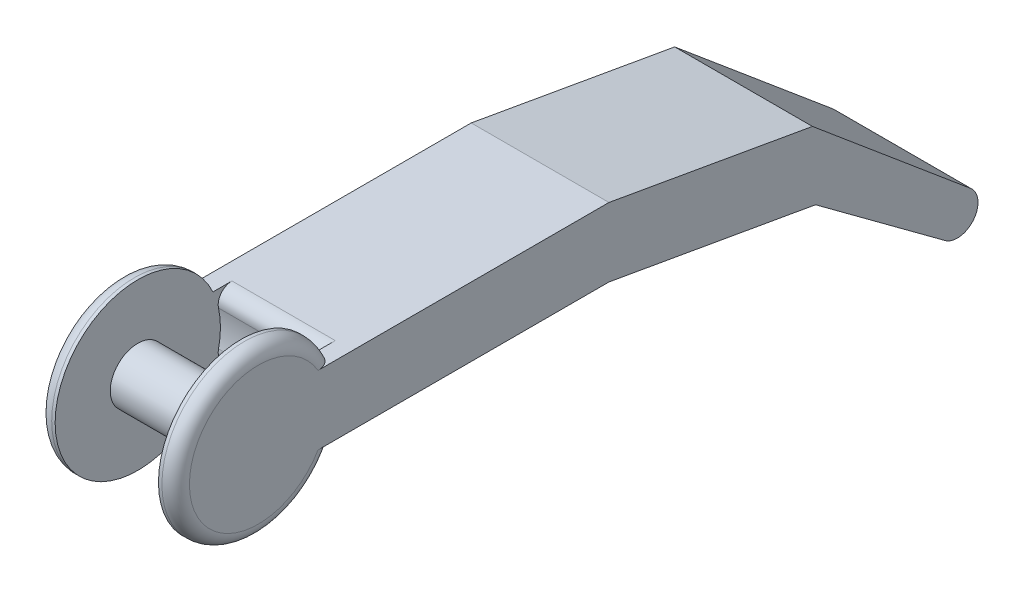
ISO-10303-21;
HEADER;
FILE_DESCRIPTION(('STEP AP214'),'2;1');
FILE_NAME('part.step','',(''),(''),'','','');
FILE_SCHEMA(('AUTOMOTIVE_DESIGN { 1 0 10303 214 1 1 1 1 }'));
ENDSEC;
DATA;
#1=APPLICATION_CONTEXT('core data for automotive mechanical design processes');
#2=APPLICATION_PROTOCOL_DEFINITION('international standard','automotive_design',2000,#1);
#3=PRODUCT_CONTEXT('',#1,'mechanical');
#4=PRODUCT('Part','Part','',(#3));
#5=PRODUCT_RELATED_PRODUCT_CATEGORY('part','',(#4));
#6=PRODUCT_DEFINITION_FORMATION('','',#4);
#7=PRODUCT_DEFINITION_CONTEXT('part definition',#1,'design');
#8=PRODUCT_DEFINITION('design','',#6,#7);
#9=PRODUCT_DEFINITION_SHAPE('','',#8);
#10=(LENGTH_UNIT() NAMED_UNIT(*) SI_UNIT(.MILLI.,.METRE.));
#11=(NAMED_UNIT(*) PLANE_ANGLE_UNIT() SI_UNIT($,.RADIAN.));
#12=(NAMED_UNIT(*) SI_UNIT($,.STERADIAN.) SOLID_ANGLE_UNIT());
#13=UNCERTAINTY_MEASURE_WITH_UNIT(LENGTH_MEASURE(1.E-05),#10,'distance_accuracy_value','');
#14=(GEOMETRIC_REPRESENTATION_CONTEXT(3) GLOBAL_UNCERTAINTY_ASSIGNED_CONTEXT((#13)) GLOBAL_UNIT_ASSIGNED_CONTEXT((#10,
#11,#12)) REPRESENTATION_CONTEXT('',''));
#15=CARTESIAN_POINT('',(0.,0.,0.));
#16=DIRECTION('',(0.,0.,1.));
#17=DIRECTION('',(1.,0.,0.));
#18=AXIS2_PLACEMENT_3D('',#15,#16,#17);
#19=CARTESIAN_POINT('',(20.,-5.00000000000001,50.9087121146357));
#20=DIRECTION('',(-1.,0.,0.));
#21=DIRECTION('',(0.,0.,1.));
#22=AXIS2_PLACEMENT_3D('',#19,#20,#21);
#23=CYLINDRICAL_SURFACE('',#22,12.);
#24=DIRECTION('',(-1.,0.,0.));
#25=VECTOR('',#24,1.);
#26=CARTESIAN_POINT('',(20.,0.,40.));
#27=LINE('',#26,#25);
#28=CARTESIAN_POINT('',(2.5,0.,40.));
#29=VERTEX_POINT('',#28);
#30=CARTESIAN_POINT('',(2.,0.,40.));
#31=VERTEX_POINT('',#30);
#32=EDGE_CURVE('E228',#29,#31,#27,.T.);
#33=ORIENTED_EDGE('',*,*,#32,.T.);
#34=CARTESIAN_POINT('',(2.,-5.00000000000001,50.9087121146357));
#35=DIRECTION('',(1.,0.,0.));
#36=DIRECTION('',(0.,0.,-1.));
#37=AXIS2_PLACEMENT_3D('',#34,#35,#36);
#38=CIRCLE('',#37,12.);
#39=CARTESIAN_POINT('',(2.,-10.,40.));
#40=VERTEX_POINT('',#39);
#41=EDGE_CURVE('E235',#31,#40,#38,.T.);
#42=ORIENTED_EDGE('',*,*,#41,.T.);
#43=DIRECTION('',(-1.,0.,0.));
#44=VECTOR('',#43,1.);
#45=CARTESIAN_POINT('',(20.,-10.,40.));
#46=LINE('',#45,#44);
#47=CARTESIAN_POINT('',(2.5,-10.,40.));
#48=VERTEX_POINT('',#47);
#49=EDGE_CURVE('E169',#48,#40,#46,.T.);
#50=ORIENTED_EDGE('',*,*,#49,.F.);
#51=CARTESIAN_POINT('',(2.5,-5.00000000000001,50.9087121146357));
#52=DIRECTION('',(1.,0.,0.));
#53=DIRECTION('',(0.,0.,-1.));
#54=AXIS2_PLACEMENT_3D('',#51,#52,#53);
#55=CIRCLE('',#54,12.);
#56=EDGE_CURVE('E217',#29,#48,#55,.T.);
#57=ORIENTED_EDGE('',*,*,#56,.F.);
#58=EDGE_LOOP('',(#33,#42,#50,#57));
#59=FACE_BOUND('',#58,.T.);
#60=ADVANCED_FACE('F34',(#59),#23,.T.);
#61=CARTESIAN_POINT('',(20.,0.,0.));
#62=DIRECTION('',(0.,-1.,0.));
#63=DIRECTION('',(0.,0.,-1.));
#64=AXIS2_PLACEMENT_3D('',#61,#62,#63);
#65=PLANE('',#64);
#66=DIRECTION('',(1.,0.,0.));
#67=VECTOR('',#66,1.);
#68=CARTESIAN_POINT('',(20.,0.,37.2339177834584));
#69=LINE('',#68,#67);
#70=CARTESIAN_POINT('',(2.5,0.,37.2339177834584));
#71=VERTEX_POINT('',#70);
#72=CARTESIAN_POINT('',(17.5,0.,37.2339177834584));
#73=VERTEX_POINT('',#72);
#74=EDGE_CURVE('E255',#71,#73,#69,.T.);
#75=ORIENTED_EDGE('',*,*,#74,.T.);
#76=DIRECTION('',(0.,0.,1.));
#77=VECTOR('',#76,1.);
#78=CARTESIAN_POINT('',(17.5,0.,0.));
#79=LINE('',#78,#77);
#80=CARTESIAN_POINT('',(17.5,0.,40.));
#81=VERTEX_POINT('',#80);
#82=EDGE_CURVE('E258',#73,#81,#79,.T.);
#83=ORIENTED_EDGE('',*,*,#82,.T.);
#84=CARTESIAN_POINT('',(18.,0.,40.));
#85=VERTEX_POINT('',#84);
#86=EDGE_CURVE('E229',#85,#81,#27,.T.);
#87=ORIENTED_EDGE('',*,*,#86,.F.);
#88=CARTESIAN_POINT('',(18.,0.,40.));
#89=CARTESIAN_POINT('',(18.052381351348,0.,39.9999920607636));
#90=CARTESIAN_POINT('',(18.104758865601,0.,40.002263560276));
#91=CARTESIAN_POINT('',(18.2091137968857,0.,40.0113045157115));
#92=CARTESIAN_POINT('',(18.2610912938276,0.,40.0180730483718));
#93=CARTESIAN_POINT('',(18.3641246451201,0.,40.0360209027283));
#94=CARTESIAN_POINT('',(18.4151827509376,0.,40.047187262346));
#95=CARTESIAN_POINT('',(18.5161560089477,0.,40.0738036078068));
#96=CARTESIAN_POINT('',(18.5660711412638,0.,40.0892536680826));
#97=CARTESIAN_POINT('',(18.7135516833984,0.,40.1418075385946));
#98=CARTESIAN_POINT('',(18.808975786502,0.,40.1851368942232));
#99=CARTESIAN_POINT('',(18.991474687455,0.,40.2867054531951));
#100=CARTESIAN_POINT('',(19.0785456934631,0.,40.344951384222));
#101=CARTESIAN_POINT('',(19.2451369172089,0.,40.4764207790665));
#102=CARTESIAN_POINT('',(19.3243239089857,0.,40.5500659671956));
#103=CARTESIAN_POINT('',(19.470365468241,0.,40.7086521318175));
#104=CARTESIAN_POINT('',(19.5372187847429,0.,40.7935942526304));
#105=CARTESIAN_POINT('',(19.6628569376939,0.,40.9799740296775));
#106=CARTESIAN_POINT('',(19.7204696150338,0.,41.082200448377));
#107=CARTESIAN_POINT('',(19.8196644461582,0.,41.2942407556589));
#108=CARTESIAN_POINT('',(19.8612274988097,0.,41.404063502776));
#109=CARTESIAN_POINT('',(19.9301190898781,0.,41.6349866048227));
#110=CARTESIAN_POINT('',(19.9564850498217,0.,41.7563718328889));
#111=CARTESIAN_POINT('',(19.9914218710675,0.,42.0013701799645));
#112=CARTESIAN_POINT('',(20.0000390550424,0.,42.1249766480399));
#113=CARTESIAN_POINT('',(20.,0.,42.2484580767913));
#114=B_SPLINE_CURVE_WITH_KNOTS('',3,(#88,#89,#90,#91,#92,#93,#94,#95,#96,#97,#98,#99,#100,#101,
#102,#103,#104,#105,#106,#107,#108,#109,#110,#111,#112,#113),.UNSPECIFIED.,.F.,.F.,(4,2,2,2,2,2,
2,2,2,2,2,2,4),(0.,0.157088262959668,0.314144284895599,0.47074082580425,0.627340087871192,
0.940166983661496,1.25313522009008,1.5761765587758,1.89925064481843,2.24984124067117,
2.6008478081623,2.97216040008188,3.34250266596835),.UNSPECIFIED.);
#115=CARTESIAN_POINT('',(20.,0.,42.2484580767913));
#116=VERTEX_POINT('',#115);
#117=EDGE_CURVE('E298',#85,#116,#114,.T.);
#118=ORIENTED_EDGE('',*,*,#117,.T.);
#119=DIRECTION('',(0.,0.,1.));
#120=VECTOR('',#119,1.);
#121=CARTESIAN_POINT('',(20.,0.,0.));
#122=LINE('',#121,#120);
#123=CARTESIAN_POINT('',(20.,0.,0.));
#124=VERTEX_POINT('',#123);
#125=EDGE_CURVE('E160',#124,#116,#122,.T.);
#126=ORIENTED_EDGE('',*,*,#125,.F.);
#127=DIRECTION('',(-1.,0.,0.));
#128=VECTOR('',#127,1.);
#129=CARTESIAN_POINT('',(20.,0.,0.));
#130=LINE('',#129,#128);
#131=CARTESIAN_POINT('',(0.,0.,0.));
#132=VERTEX_POINT('',#131);
#133=EDGE_CURVE('E232',#124,#132,#130,.T.);
#134=ORIENTED_EDGE('',*,*,#133,.T.);
#135=DIRECTION('',(0.,0.,1.));
#136=VECTOR('',#135,1.);
#137=CARTESIAN_POINT('',(0.,0.,0.));
#138=LINE('',#137,#136);
#139=CARTESIAN_POINT('',(0.,0.,42.2484580767913));
#140=VERTEX_POINT('',#139);
#141=EDGE_CURVE('E161',#132,#140,#138,.T.);
#142=ORIENTED_EDGE('',*,*,#141,.T.);
#143=CARTESIAN_POINT('',(0.,0.,42.2484580767913));
#144=CARTESIAN_POINT('',(4.8833210205639E-06,0.,42.1780449974531));
#145=CARTESIAN_POINT('',(0.00279075934594604,0.,42.107657599263));
#146=CARTESIAN_POINT('',(0.0140363254196324,0.,41.9673048664754));
#147=CARTESIAN_POINT('',(0.0224987825539634,0.,41.8973397545144));
#148=CARTESIAN_POINT('',(0.0566586694762077,0.,41.6881638020816));
#149=CARTESIAN_POINT('',(0.0911305976199109,0.,41.5502606044559));
#150=CARTESIAN_POINT('',(0.183906293736824,0.,41.2821861846151));
#151=CARTESIAN_POINT('',(0.242288091272972,0.,41.1520418917903));
#152=CARTESIAN_POINT('',(0.382392919044137,0.,40.9051955188518));
#153=CARTESIAN_POINT('',(0.464062182699028,0.,40.7884633336651));
#154=CARTESIAN_POINT('',(0.639724376170037,0.,40.5845853112575));
#155=CARTESIAN_POINT('',(0.731625212290166,0.,40.4956390915064));
#156=CARTESIAN_POINT('',(0.930766416202459,0.,40.3367937467113));
#157=CARTESIAN_POINT('',(1.03800534271632,0.,40.2668928338227));
#158=CARTESIAN_POINT('',(1.25145083020004,0.,40.1564326431026));
#159=CARTESIAN_POINT('',(1.35641215028951,0.,40.1134546791329));
#160=CARTESIAN_POINT('',(1.57230306403472,0.,40.0473924478884));
#161=CARTESIAN_POINT('',(1.68321854919432,0.,40.0242631832956));
#162=CARTESIAN_POINT('',(1.82916894284576,0.,40.0077146311767));
#163=CARTESIAN_POINT('',(1.86329784951192,0.,40.004821058003));
#164=CARTESIAN_POINT('',(1.93161241425359,0.,40.0009665770984));
#165=CARTESIAN_POINT('',(1.96579790614384,0.,40.0000027255737));
#166=CARTESIAN_POINT('',(1.99999999999999,0.,40.));
#167=B_SPLINE_CURVE_WITH_KNOTS('',3,(#143,#144,#145,#146,#147,#148,#149,#150,#151,#152,#153,
#154,#155,#156,#157,#158,#159,#160,#161,#162,#163,#164,#165,#166),.UNSPECIFIED.,.F.,.F.,(4,2,2,
2,2,2,2,2,2,2,2,4),(0.,0.21112738577294,0.422357761792289,0.84656219445089,1.27216218668594,
1.69678739274252,2.07831513246147,2.45980704458993,2.79831280234283,3.13604911945941,
3.23876550054803,3.34132506785181),.UNSPECIFIED.);
#168=EDGE_CURVE('E267',#140,#31,#167,.T.);
#169=ORIENTED_EDGE('',*,*,#168,.T.);
#170=ORIENTED_EDGE('',*,*,#32,.F.);
#171=DIRECTION('',(0.,0.,-1.));
#172=VECTOR('',#171,1.);
#173=CARTESIAN_POINT('',(2.5,0.,50.9087121146357));
#174=LINE('',#173,#172);
#175=EDGE_CURVE('E48',#29,#71,#174,.T.);
#176=ORIENTED_EDGE('',*,*,#175,.T.);
#177=EDGE_LOOP('',(#75,#83,#87,#118,#126,#134,#142,#169,#170,#176));
#178=FACE_BOUND('',#177,.T.);
#179=ADVANCED_FACE('F284',(#178),#65,.F.);
#180=CARTESIAN_POINT('',(18.,-10.,40.));
#181=VERTEX_POINT('',#180);
#182=CARTESIAN_POINT('',(17.5,-10.,40.));
#183=VERTEX_POINT('',#182);
#184=EDGE_CURVE('E226',#181,#183,#46,.T.);
#185=ORIENTED_EDGE('',*,*,#184,.F.);
#186=CARTESIAN_POINT('',(18.,-5.00000000000001,50.9087121146357));
#187=DIRECTION('',(1.,0.,0.));
#188=DIRECTION('',(0.,0.,-1.));
#189=AXIS2_PLACEMENT_3D('',#186,#187,#188);
#190=CIRCLE('',#189,12.);
#191=EDGE_CURVE('E243',#181,#85,#190,.F.);
#192=ORIENTED_EDGE('',*,*,#191,.T.);
#193=ORIENTED_EDGE('',*,*,#86,.T.);
#194=CARTESIAN_POINT('',(17.5,-5.00000000000001,50.9087121146357));
#195=DIRECTION('',(1.,0.,0.));
#196=DIRECTION('',(0.,0.,-1.));
#197=AXIS2_PLACEMENT_3D('',#194,#195,#196);
#198=CIRCLE('',#197,12.);
#199=EDGE_CURVE('E220',#81,#183,#198,.T.);
#200=ORIENTED_EDGE('',*,*,#199,.T.);
#201=EDGE_LOOP('',(#185,#192,#193,#200));
#202=FACE_BOUND('',#201,.T.);
#203=ADVANCED_FACE('F339',(#202),#23,.T.);
#204=CARTESIAN_POINT('',(20.,-10.,40.));
#205=DIRECTION('',(0.,1.,0.));
#206=DIRECTION('',(0.,0.,1.));
#207=AXIS2_PLACEMENT_3D('',#204,#205,#206);
#208=PLANE('',#207);
#209=DIRECTION('',(1.,0.,0.));
#210=VECTOR('',#209,1.);
#211=CARTESIAN_POINT('',(20.,-10.,37.2339177834584));
#212=LINE('',#211,#210);
#213=CARTESIAN_POINT('',(17.5,-10.,37.2339177834584));
#214=VERTEX_POINT('',#213);
#215=CARTESIAN_POINT('',(2.5,-10.,37.2339177834584));
#216=VERTEX_POINT('',#215);
#217=EDGE_CURVE('E246',#214,#216,#212,.F.);
#218=ORIENTED_EDGE('',*,*,#217,.T.);
#219=DIRECTION('',(0.,0.,1.));
#220=VECTOR('',#219,1.);
#221=CARTESIAN_POINT('',(2.5,-10.,50.9087121146357));
#222=LINE('',#221,#220);
#223=EDGE_CURVE('E248',#216,#48,#222,.T.);
#224=ORIENTED_EDGE('',*,*,#223,.T.);
#225=ORIENTED_EDGE('',*,*,#49,.T.);
#226=CARTESIAN_POINT('',(2.,-10.,40.));
#227=CARTESIAN_POINT('',(1.94761864865197,-10.,39.9999920607636));
#228=CARTESIAN_POINT('',(1.89524113439899,-10.,40.002263560276));
#229=CARTESIAN_POINT('',(1.79088620311427,-10.,40.0113045157115));
#230=CARTESIAN_POINT('',(1.73890870617236,-10.,40.0180730483718));
#231=CARTESIAN_POINT('',(1.63587535487992,-10.,40.0360209027283));
#232=CARTESIAN_POINT('',(1.5848172490624,-10.,40.047187262346));
#233=CARTESIAN_POINT('',(1.48384399105233,-10.,40.0738036078068));
#234=CARTESIAN_POINT('',(1.43392885873615,-10.,40.0892536680826));
#235=CARTESIAN_POINT('',(1.28644831660157,-10.,40.1418075385946));
#236=CARTESIAN_POINT('',(1.19102421349795,-10.,40.1851368942232));
#237=CARTESIAN_POINT('',(1.00852531254499,-10.,40.2867054531951));
#238=CARTESIAN_POINT('',(0.921454306536902,-10.,40.344951384222));
#239=CARTESIAN_POINT('',(0.754863082791112,-10.,40.4764207790665));
#240=CARTESIAN_POINT('',(0.675676091014277,-10.,40.5500659671956));
#241=CARTESIAN_POINT('',(0.529634531758966,-10.,40.7086521318175));
#242=CARTESIAN_POINT('',(0.462781215257148,-10.,40.7935942526304));
#243=CARTESIAN_POINT('',(0.337143062306125,-10.,40.9799740296775));
#244=CARTESIAN_POINT('',(0.279530384966253,-10.,41.0822004483769));
#245=CARTESIAN_POINT('',(0.180335553841795,-10.,41.2942407556589));
#246=CARTESIAN_POINT('',(0.138772501190279,-10.,41.404063502776));
#247=CARTESIAN_POINT('',(0.0698809101218755,-10.,41.6349866048227));
#248=CARTESIAN_POINT('',(0.0435149501782898,-10.,41.7563718328889));
#249=CARTESIAN_POINT('',(0.00857812893248836,-10.,42.0013701799645));
#250=CARTESIAN_POINT('',(-3.90550423731312E-05,-10.,42.1249766480399));
#251=CARTESIAN_POINT('',(0.,-10.,42.2484580767913));
#252=B_SPLINE_CURVE_WITH_KNOTS('',3,(#226,#227,#228,#229,#230,#231,#232,#233,#234,#235,#236,
#237,#238,#239,#240,#241,#242,#243,#244,#245,#246,#247,#248,#249,#250,#251),.UNSPECIFIED.,.F.,
.F.,(4,2,2,2,2,2,2,2,2,2,2,2,4),(0.,0.157088262959667,0.314144284895595,0.470740825804248,
0.627340087871189,0.940166983661497,1.25313522009008,1.5761765587758,1.89925064481842,
2.24984124067116,2.6008478081623,2.97216040008188,3.34250266596835),.UNSPECIFIED.);
#253=CARTESIAN_POINT('',(0.,-10.,42.2484580767913));
#254=VERTEX_POINT('',#253);
#255=EDGE_CURVE('E155',#40,#254,#252,.T.);
#256=ORIENTED_EDGE('',*,*,#255,.T.);
#257=DIRECTION('',(0.,0.,-1.));
#258=VECTOR('',#257,1.);
#259=CARTESIAN_POINT('',(0.,-10.,40.));
#260=LINE('',#259,#258);
#261=CARTESIAN_POINT('',(0.,-10.,0.));
#262=VERTEX_POINT('',#261);
#263=EDGE_CURVE('E148',#254,#262,#260,.T.);
#264=ORIENTED_EDGE('',*,*,#263,.T.);
#265=DIRECTION('',(-1.,0.,0.));
#266=VECTOR('',#265,1.);
#267=CARTESIAN_POINT('',(20.,-10.,0.));
#268=LINE('',#267,#266);
#269=CARTESIAN_POINT('',(20.,-10.,0.));
#270=VERTEX_POINT('',#269);
#271=EDGE_CURVE('E152',#270,#262,#268,.T.);
#272=ORIENTED_EDGE('',*,*,#271,.F.);
#273=DIRECTION('',(0.,0.,-1.));
#274=VECTOR('',#273,1.);
#275=CARTESIAN_POINT('',(20.,-10.,40.));
#276=LINE('',#275,#274);
#277=CARTESIAN_POINT('',(20.,-10.,42.2484580767913));
#278=VERTEX_POINT('',#277);
#279=EDGE_CURVE('E170',#278,#270,#276,.T.);
#280=ORIENTED_EDGE('',*,*,#279,.F.);
#281=CARTESIAN_POINT('',(20.,-10.,42.2484580767913));
#282=CARTESIAN_POINT('',(19.999995116679,-10.,42.1780449974531));
#283=CARTESIAN_POINT('',(19.9972092406541,-10.,42.107657599263));
#284=CARTESIAN_POINT('',(19.9859636745804,-10.,41.9673048664754));
#285=CARTESIAN_POINT('',(19.977501217446,-10.,41.8973397545144));
#286=CARTESIAN_POINT('',(19.9433413305238,-10.,41.6881638020816));
#287=CARTESIAN_POINT('',(19.9088694023801,-10.,41.5502606044559));
#288=CARTESIAN_POINT('',(19.8160937062632,-10.,41.2821861846151));
#289=CARTESIAN_POINT('',(19.757711908727,-10.,41.1520418917903));
#290=CARTESIAN_POINT('',(19.6176070809559,-10.,40.9051955188518));
#291=CARTESIAN_POINT('',(19.535937817301,-10.,40.7884633336651));
#292=CARTESIAN_POINT('',(19.36027562383,-10.,40.5845853112575));
#293=CARTESIAN_POINT('',(19.2683747877098,-10.,40.4956390915064));
#294=CARTESIAN_POINT('',(19.0692335837975,-10.,40.3367937467113));
#295=CARTESIAN_POINT('',(18.9619946572837,-10.,40.2668928338227));
#296=CARTESIAN_POINT('',(18.7485491698,-10.,40.1564326431026));
#297=CARTESIAN_POINT('',(18.6435878497105,-10.,40.1134546791329));
#298=CARTESIAN_POINT('',(18.4276969359653,-10.,40.0473924478884));
#299=CARTESIAN_POINT('',(18.3167814508057,-10.,40.0242631832956));
#300=CARTESIAN_POINT('',(18.1708310571542,-10.,40.0077146311767));
#301=CARTESIAN_POINT('',(18.1367021504881,-10.,40.004821058003));
#302=CARTESIAN_POINT('',(18.0683875857464,-10.,40.0009665770984));
#303=CARTESIAN_POINT('',(18.0342020938562,-10.,40.0000027255737));
#304=CARTESIAN_POINT('',(18.,-10.,40.));
#305=B_SPLINE_CURVE_WITH_KNOTS('',3,(#281,#282,#283,#284,#285,#286,#287,#288,#289,#290,#291,
#292,#293,#294,#295,#296,#297,#298,#299,#300,#301,#302,#303,#304),.UNSPECIFIED.,.F.,.F.,(4,2,2,
2,2,2,2,2,2,2,2,4),(0.,0.211127385772926,0.422357761792289,0.84656219445089,1.27216218668593,
1.69678739274252,2.07831513246148,2.45980704458993,2.79831280234283,3.13604911945941,
3.23876550054804,3.34132506785182),.UNSPECIFIED.);
#306=EDGE_CURVE('E292',#278,#181,#305,.T.);
#307=ORIENTED_EDGE('',*,*,#306,.T.);
#308=ORIENTED_EDGE('',*,*,#184,.T.);
#309=DIRECTION('',(0.,0.,-1.));
#310=VECTOR('',#309,1.);
#311=CARTESIAN_POINT('',(17.5,-10.,40.));
#312=LINE('',#311,#310);
#313=EDGE_CURVE('E56',#183,#214,#312,.T.);
#314=ORIENTED_EDGE('',*,*,#313,.T.);
#315=EDGE_LOOP('',(#218,#224,#225,#256,#264,#272,#280,#307,#308,#314));
#316=FACE_BOUND('',#315,.T.);
#317=ADVANCED_FACE('F151',(#316),#208,.F.);
#318=CARTESIAN_POINT('',(20.,-5.00000000000001,50.9087121146357));
#319=DIRECTION('',(1.,0.,0.));
#320=DIRECTION('',(0.,0.,-1.));
#321=AXIS2_PLACEMENT_3D('',#318,#319,#320);
#322=PLANE('',#321);
#323=CARTESIAN_POINT('',(20.,-5.00000000000001,50.9087121146357));
#324=DIRECTION('',(1.,0.,0.));
#325=DIRECTION('',(0.,0.,-1.));
#326=AXIS2_PLACEMENT_3D('',#323,#324,#325);
#327=CIRCLE('',#326,10.);
#328=EDGE_CURVE('E240',#116,#278,#327,.T.);
#329=ORIENTED_EDGE('',*,*,#328,.T.);
#330=ORIENTED_EDGE('',*,*,#279,.T.);
#331=DIRECTION('',(0.,-0.173648177666924,-0.984807753012209));
#332=VECTOR('',#331,1.);
#333=CARTESIAN_POINT('',(20.,-10.,0.));
#334=LINE('',#333,#332);
#335=CARTESIAN_POINT('',(20.,-15.2898094212537,-30.));
#336=VERTEX_POINT('',#335);
#337=EDGE_CURVE('E168',#270,#336,#334,.T.);
#338=ORIENTED_EDGE('',*,*,#337,.T.);
#339=DIRECTION('',(0.,-0.594411150479848,-0.80416129239427));
#340=VECTOR('',#339,1.);
#341=CARTESIAN_POINT('',(20.,-15.2898094212537,-30.));
#342=LINE('',#341,#340);
#343=CARTESIAN_POINT('',(20.,-29.0892775189153,-48.668892888047));
#344=VERTEX_POINT('',#343);
#345=EDGE_CURVE('E195',#336,#344,#342,.T.);
#346=ORIENTED_EDGE('',*,*,#345,.T.);
#347=CARTESIAN_POINT('',(20.,-26.7810983085083,-50.5852197736917));
#348=DIRECTION('',(1.,0.,0.));
#349=DIRECTION('',(0.,0.,1.));
#350=AXIS2_PLACEMENT_3D('',#347,#348,#349);
#351=CIRCLE('',#350,3.);
#352=CARTESIAN_POINT('',(20.,-24.4930736206038,-52.5255658839357));
#353=VERTEX_POINT('',#352);
#354=EDGE_CURVE('E198',#344,#353,#351,.T.);
#355=ORIENTED_EDGE('',*,*,#354,.T.);
#356=DIRECTION('',(0.,0.642787609686535,0.766044443118982));
#357=VECTOR('',#356,1.);
#358=CARTESIAN_POINT('',(20.,-5.20944533000771,-29.5442325903663));
#359=LINE('',#358,#357);
#360=CARTESIAN_POINT('',(20.,-5.20944533000771,-29.5442325903663));
#361=VERTEX_POINT('',#360);
#362=EDGE_CURVE('E182',#353,#361,#359,.T.);
#363=ORIENTED_EDGE('',*,*,#362,.T.);
#364=DIRECTION('',(0.,0.173648177666924,0.984807753012209));
#365=VECTOR('',#364,1.);
#366=CARTESIAN_POINT('',(20.,0.,0.));
#367=LINE('',#366,#365);
#368=EDGE_CURVE('E177',#361,#124,#367,.T.);
#369=ORIENTED_EDGE('',*,*,#368,.T.);
#370=ORIENTED_EDGE('',*,*,#125,.T.);
#371=EDGE_LOOP('',(#329,#330,#338,#346,#355,#363,#369,#370));
#372=FACE_BOUND('',#371,.T.);
#373=ADVANCED_FACE('F348',(#372),#322,.T.);
#374=CARTESIAN_POINT('',(0.,-5.00000000000001,50.9087121146357));
#375=DIRECTION('',(1.,0.,0.));
#376=DIRECTION('',(0.,0.,-1.));
#377=AXIS2_PLACEMENT_3D('',#374,#375,#376);
#378=PLANE('',#377);
#379=ORIENTED_EDGE('',*,*,#263,.F.);
#380=CARTESIAN_POINT('',(0.,-5.00000000000001,50.9087121146357));
#381=DIRECTION('',(1.,0.,0.));
#382=DIRECTION('',(0.,0.,-1.));
#383=AXIS2_PLACEMENT_3D('',#380,#381,#382);
#384=CIRCLE('',#383,10.);
#385=EDGE_CURVE('E238',#254,#140,#384,.F.);
#386=ORIENTED_EDGE('',*,*,#385,.T.);
#387=ORIENTED_EDGE('',*,*,#141,.F.);
#388=DIRECTION('',(0.,0.173648177666924,0.984807753012209));
#389=VECTOR('',#388,1.);
#390=CARTESIAN_POINT('',(0.,0.,0.));
#391=LINE('',#390,#389);
#392=CARTESIAN_POINT('',(0.,-5.20944533000771,-29.5442325903663));
#393=VERTEX_POINT('',#392);
#394=EDGE_CURVE('E190',#393,#132,#391,.T.);
#395=ORIENTED_EDGE('',*,*,#394,.F.);
#396=DIRECTION('',(0.,0.642787609686535,0.766044443118982));
#397=VECTOR('',#396,1.);
#398=CARTESIAN_POINT('',(0.,-5.20944533000771,-29.5442325903663));
#399=LINE('',#398,#397);
#400=CARTESIAN_POINT('',(0.,-24.4930736206038,-52.5255658839357));
#401=VERTEX_POINT('',#400);
#402=EDGE_CURVE('E187',#401,#393,#399,.T.);
#403=ORIENTED_EDGE('',*,*,#402,.F.);
#404=CARTESIAN_POINT('',(0.,-26.7810983085083,-50.5852197736917));
#405=DIRECTION('',(1.,0.,0.));
#406=DIRECTION('',(0.,0.,1.));
#407=AXIS2_PLACEMENT_3D('',#404,#405,#406);
#408=CIRCLE('',#407,3.);
#409=CARTESIAN_POINT('',(0.,-29.0892775189153,-48.668892888047));
#410=VERTEX_POINT('',#409);
#411=EDGE_CURVE('E179',#410,#401,#408,.T.);
#412=ORIENTED_EDGE('',*,*,#411,.F.);
#413=DIRECTION('',(0.,-0.594411150479848,-0.80416129239427));
#414=VECTOR('',#413,1.);
#415=CARTESIAN_POINT('',(0.,-15.2898094212537,-30.));
#416=LINE('',#415,#414);
#417=CARTESIAN_POINT('',(0.,-15.2898094212537,-30.));
#418=VERTEX_POINT('',#417);
#419=EDGE_CURVE('E176',#418,#410,#416,.T.);
#420=ORIENTED_EDGE('',*,*,#419,.F.);
#421=DIRECTION('',(0.,-0.173648177666924,-0.984807753012209));
#422=VECTOR('',#421,1.);
#423=CARTESIAN_POINT('',(0.,-10.,0.));
#424=LINE('',#423,#422);
#425=EDGE_CURVE('E166',#262,#418,#424,.T.);
#426=ORIENTED_EDGE('',*,*,#425,.F.);
#427=EDGE_LOOP('',(#379,#386,#387,#395,#403,#412,#420,#426));
#428=FACE_BOUND('',#427,.T.);
#429=ADVANCED_FACE('F173',(#428),#378,.F.);
#430=CARTESIAN_POINT('',(2.5,-5.00000000000001,50.9087121146357));
#431=DIRECTION('',(1.,0.,0.));
#432=DIRECTION('',(0.,0.,-1.));
#433=AXIS2_PLACEMENT_3D('',#430,#431,#432);
#434=CYLINDRICAL_SURFACE('',#433,12.);
#435=CARTESIAN_POINT('',(2.5,-7.57142857142858,39.1874598307694));
#436=VERTEX_POINT('',#435);
#437=CARTESIAN_POINT('',(2.5,-2.42857142857143,39.1874598307694));
#438=VERTEX_POINT('',#437);
#439=EDGE_CURVE('E219',#436,#438,#55,.T.);
#440=ORIENTED_EDGE('',*,*,#439,.F.);
#441=DIRECTION('',(1.,0.,0.));
#442=VECTOR('',#441,1.);
#443=CARTESIAN_POINT('',(2.5,-7.57142857142858,39.1874598307694));
#444=LINE('',#443,#442);
#445=CARTESIAN_POINT('',(17.5,-7.57142857142858,39.1874598307694));
#446=VERTEX_POINT('',#445);
#447=EDGE_CURVE('E252',#436,#446,#444,.T.);
#448=ORIENTED_EDGE('',*,*,#447,.T.);
#449=CARTESIAN_POINT('',(17.5,-2.42857142857143,39.1874598307694));
#450=VERTEX_POINT('',#449);
#451=EDGE_CURVE('E214',#446,#450,#198,.T.);
#452=ORIENTED_EDGE('',*,*,#451,.T.);
#453=DIRECTION('',(1.,0.,0.));
#454=VECTOR('',#453,1.);
#455=CARTESIAN_POINT('',(2.5,-2.42857142857143,39.1874598307694));
#456=LINE('',#455,#454);
#457=EDGE_CURVE('E250',#450,#438,#456,.F.);
#458=ORIENTED_EDGE('',*,*,#457,.T.);
#459=EDGE_LOOP('',(#440,#448,#452,#458));
#460=FACE_BOUND('',#459,.T.);
#461=ADVANCED_FACE('F318',(#460),#434,.F.);
#462=CARTESIAN_POINT('',(2.5,-5.00000000000001,50.9087121146357));
#463=DIRECTION('',(1.,0.,0.));
#464=DIRECTION('',(0.,0.,-1.));
#465=AXIS2_PLACEMENT_3D('',#462,#463,#464);
#466=PLANE('',#465);
#467=CARTESIAN_POINT('',(2.5,-5.00000000000001,50.9087121146357));
#468=DIRECTION('',(1.,0.,0.));
#469=DIRECTION('',(0.,0.,-1.));
#470=AXIS2_PLACEMENT_3D('',#467,#468,#469);
#471=CIRCLE('',#470,4.00000000000001);
#472=CARTESIAN_POINT('',(2.5,-5.00000000000001,46.9087121146357));
#473=VERTEX_POINT('',#472);
#474=EDGE_CURVE('E211',#473,#473,#471,.T.);
#475=ORIENTED_EDGE('',*,*,#474,.F.);
#476=EDGE_LOOP('',(#475));
#477=FACE_BOUND('',#476,.T.);
#478=ORIENTED_EDGE('',*,*,#56,.T.);
#479=ORIENTED_EDGE('',*,*,#223,.F.);
#480=CARTESIAN_POINT('',(2.5,-8.00000000000001,37.2339177834584));
#481=DIRECTION('',(1.,0.,0.));
#482=DIRECTION('',(0.,0.,-1.));
#483=AXIS2_PLACEMENT_3D('',#480,#481,#482);
#484=CIRCLE('',#483,2.);
#485=EDGE_CURVE('E305',#216,#436,#484,.F.);
#486=ORIENTED_EDGE('',*,*,#485,.T.);
#487=ORIENTED_EDGE('',*,*,#439,.T.);
#488=CARTESIAN_POINT('',(2.5,-2.,37.2339177834584));
#489=DIRECTION('',(1.,0.,0.));
#490=DIRECTION('',(0.,0.,-1.));
#491=AXIS2_PLACEMENT_3D('',#488,#489,#490);
#492=CIRCLE('',#491,2.);
#493=EDGE_CURVE('E11',#438,#71,#492,.F.);
#494=ORIENTED_EDGE('',*,*,#493,.T.);
#495=ORIENTED_EDGE('',*,*,#175,.F.);
#496=EDGE_LOOP('',(#478,#479,#486,#487,#494,#495));
#497=FACE_BOUND('',#496,.T.);
#498=ADVANCED_FACE('F322',(#477,#497),#466,.T.);
#499=CARTESIAN_POINT('',(17.5,-5.00000000000001,50.9087121146357));
#500=DIRECTION('',(1.,0.,0.));
#501=DIRECTION('',(0.,0.,-1.));
#502=AXIS2_PLACEMENT_3D('',#499,#500,#501);
#503=PLANE('',#502);
#504=CARTESIAN_POINT('',(17.5,-5.00000000000001,50.9087121146357));
#505=DIRECTION('',(1.,0.,0.));
#506=DIRECTION('',(0.,0.,-1.));
#507=AXIS2_PLACEMENT_3D('',#504,#505,#506);
#508=CIRCLE('',#507,4.00000000000001);
#509=CARTESIAN_POINT('',(17.5,-5.00000000000001,46.9087121146357));
#510=VERTEX_POINT('',#509);
#511=EDGE_CURVE('E205',#510,#510,#508,.T.);
#512=ORIENTED_EDGE('',*,*,#511,.T.);
#513=EDGE_LOOP('',(#512));
#514=FACE_BOUND('',#513,.T.);
#515=ORIENTED_EDGE('',*,*,#199,.F.);
#516=ORIENTED_EDGE('',*,*,#82,.F.);
#517=CARTESIAN_POINT('',(17.5,-2.,37.2339177834584));
#518=DIRECTION('',(1.,0.,0.));
#519=DIRECTION('',(0.,0.,-1.));
#520=AXIS2_PLACEMENT_3D('',#517,#518,#519);
#521=CIRCLE('',#520,2.);
#522=EDGE_CURVE('E42',#73,#450,#521,.T.);
#523=ORIENTED_EDGE('',*,*,#522,.T.);
#524=ORIENTED_EDGE('',*,*,#451,.F.);
#525=CARTESIAN_POINT('',(17.5,-8.00000000000001,37.2339177834584));
#526=DIRECTION('',(1.,0.,0.));
#527=DIRECTION('',(0.,0.,-1.));
#528=AXIS2_PLACEMENT_3D('',#525,#526,#527);
#529=CIRCLE('',#528,2.);
#530=EDGE_CURVE('E307',#446,#214,#529,.T.);
#531=ORIENTED_EDGE('',*,*,#530,.T.);
#532=ORIENTED_EDGE('',*,*,#313,.F.);
#533=EDGE_LOOP('',(#515,#516,#523,#524,#531,#532));
#534=FACE_BOUND('',#533,.T.);
#535=ADVANCED_FACE('F311',(#514,#534),#503,.F.);
#536=CARTESIAN_POINT('',(2.5,-5.00000000000001,50.9087121146357));
#537=DIRECTION('',(1.,0.,0.));
#538=DIRECTION('',(0.,0.,-1.));
#539=AXIS2_PLACEMENT_3D('',#536,#537,#538);
#540=CYLINDRICAL_SURFACE('',#539,4.00000000000001);
#541=ORIENTED_EDGE('',*,*,#474,.T.);
#542=EDGE_LOOP('',(#541));
#543=FACE_BOUND('',#542,.T.);
#544=ORIENTED_EDGE('',*,*,#511,.F.);
#545=EDGE_LOOP('',(#544));
#546=FACE_BOUND('',#545,.T.);
#547=ADVANCED_FACE('F282',(#543,#546),#540,.T.);
#548=CARTESIAN_POINT('',(2.,-5.00000000000001,50.9087121146357));
#549=DIRECTION('',(1.,0.,0.));
#550=DIRECTION('',(0.,0.,-1.));
#551=AXIS2_PLACEMENT_3D('',#548,#549,#550);
#552=TOROIDAL_SURFACE('',#551,10.,2.);
#553=ORIENTED_EDGE('',*,*,#168,.F.);
#554=ORIENTED_EDGE('',*,*,#385,.F.);
#555=ORIENTED_EDGE('',*,*,#255,.F.);
#556=ORIENTED_EDGE('',*,*,#41,.F.);
#557=EDGE_LOOP('',(#553,#554,#555,#556));
#558=FACE_BOUND('',#557,.T.);
#559=ADVANCED_FACE('F277',(#558),#552,.T.);
#560=CARTESIAN_POINT('',(18.,-5.00000000000001,50.9087121146357));
#561=DIRECTION('',(1.,0.,0.));
#562=DIRECTION('',(0.,0.,-1.));
#563=AXIS2_PLACEMENT_3D('',#560,#561,#562);
#564=TOROIDAL_SURFACE('',#563,10.,2.);
#565=ORIENTED_EDGE('',*,*,#117,.F.);
#566=ORIENTED_EDGE('',*,*,#191,.F.);
#567=ORIENTED_EDGE('',*,*,#306,.F.);
#568=ORIENTED_EDGE('',*,*,#328,.F.);
#569=EDGE_LOOP('',(#565,#566,#567,#568));
#570=FACE_BOUND('',#569,.T.);
#571=ADVANCED_FACE('F281',(#570),#564,.T.);
#572=CARTESIAN_POINT('',(2.5,-8.00000000000001,37.2339177834584));
#573=DIRECTION('',(1.,0.,0.));
#574=DIRECTION('',(0.,0.,-1.));
#575=AXIS2_PLACEMENT_3D('',#572,#573,#574);
#576=CYLINDRICAL_SURFACE('',#575,2.);
#577=ORIENTED_EDGE('',*,*,#530,.F.);
#578=ORIENTED_EDGE('',*,*,#447,.F.);
#579=ORIENTED_EDGE('',*,*,#485,.F.);
#580=ORIENTED_EDGE('',*,*,#217,.F.);
#581=EDGE_LOOP('',(#577,#578,#579,#580));
#582=FACE_BOUND('',#581,.T.);
#583=ADVANCED_FACE('F289',(#582),#576,.T.);
#584=CARTESIAN_POINT('',(2.5,-2.,37.2339177834584));
#585=DIRECTION('',(1.,0.,0.));
#586=DIRECTION('',(0.,0.,-1.));
#587=AXIS2_PLACEMENT_3D('',#584,#585,#586);
#588=CYLINDRICAL_SURFACE('',#587,2.);
#589=ORIENTED_EDGE('',*,*,#493,.F.);
#590=ORIENTED_EDGE('',*,*,#457,.F.);
#591=ORIENTED_EDGE('',*,*,#522,.F.);
#592=ORIENTED_EDGE('',*,*,#74,.F.);
#593=EDGE_LOOP('',(#589,#590,#591,#592));
#594=FACE_BOUND('',#593,.T.);
#595=ADVANCED_FACE('F36',(#594),#588,.T.);
#596=CARTESIAN_POINT('',(0.,0.,0.));
#597=DIRECTION('',(0.,0.984807753012209,-0.173648177666924));
#598=DIRECTION('',(0.,0.173648177666924,0.984807753012209));
#599=AXIS2_PLACEMENT_3D('',#596,#597,#598);
#600=PLANE('',#599);
#601=ORIENTED_EDGE('',*,*,#368,.F.);
#602=DIRECTION('',(1.,0.,0.));
#603=VECTOR('',#602,1.);
#604=CARTESIAN_POINT('',(0.,-5.20944533000771,-29.5442325903663));
#605=LINE('',#604,#603);
#606=EDGE_CURVE('E203',#393,#361,#605,.T.);
#607=ORIENTED_EDGE('',*,*,#606,.F.);
#608=ORIENTED_EDGE('',*,*,#394,.T.);
#609=ORIENTED_EDGE('',*,*,#133,.F.);
#610=EDGE_LOOP('',(#601,#607,#608,#609));
#611=FACE_BOUND('',#610,.T.);
#612=ADVANCED_FACE('F337',(#611),#600,.T.);
#613=CARTESIAN_POINT('',(0.,-5.20944533000771,-29.5442325903663));
#614=DIRECTION('',(0.,0.766044443118982,-0.642787609686535));
#615=DIRECTION('',(0.,0.642787609686535,0.766044443118982));
#616=AXIS2_PLACEMENT_3D('',#613,#614,#615);
#617=PLANE('',#616);
#618=ORIENTED_EDGE('',*,*,#362,.F.);
#619=DIRECTION('',(1.,0.,0.));
#620=VECTOR('',#619,1.);
#621=CARTESIAN_POINT('',(0.,-24.4930736206038,-52.5255658839357));
#622=LINE('',#621,#620);
#623=EDGE_CURVE('E206',#401,#353,#622,.T.);
#624=ORIENTED_EDGE('',*,*,#623,.F.);
#625=ORIENTED_EDGE('',*,*,#402,.T.);
#626=ORIENTED_EDGE('',*,*,#606,.T.);
#627=EDGE_LOOP('',(#618,#624,#625,#626));
#628=FACE_BOUND('',#627,.T.);
#629=ADVANCED_FACE('F363',(#628),#617,.T.);
#630=CARTESIAN_POINT('',(0.,-26.7810983085083,-50.5852197736917));
#631=DIRECTION('',(1.,0.,0.));
#632=DIRECTION('',(0.,0.,-1.));
#633=AXIS2_PLACEMENT_3D('',#630,#631,#632);
#634=CYLINDRICAL_SURFACE('',#633,3.);
#635=ORIENTED_EDGE('',*,*,#354,.F.);
#636=DIRECTION('',(1.,0.,0.));
#637=VECTOR('',#636,1.);
#638=CARTESIAN_POINT('',(0.,-29.0892775189153,-48.668892888047));
#639=LINE('',#638,#637);
#640=EDGE_CURVE('E208',#410,#344,#639,.T.);
#641=ORIENTED_EDGE('',*,*,#640,.F.);
#642=ORIENTED_EDGE('',*,*,#411,.T.);
#643=ORIENTED_EDGE('',*,*,#623,.T.);
#644=EDGE_LOOP('',(#635,#641,#642,#643));
#645=FACE_BOUND('',#644,.T.);
#646=ADVANCED_FACE('F369',(#645),#634,.T.);
#647=CARTESIAN_POINT('',(0.,-15.2898094212537,-30.));
#648=DIRECTION('',(0.,-0.80416129239427,0.594411150479849));
#649=DIRECTION('',(0.,-0.594411150479849,-0.80416129239427));
#650=AXIS2_PLACEMENT_3D('',#647,#648,#649);
#651=PLANE('',#650);
#652=ORIENTED_EDGE('',*,*,#345,.F.);
#653=DIRECTION('',(1.,0.,0.));
#654=VECTOR('',#653,1.);
#655=CARTESIAN_POINT('',(0.,-15.2898094212537,-30.));
#656=LINE('',#655,#654);
#657=EDGE_CURVE('E193',#418,#336,#656,.T.);
#658=ORIENTED_EDGE('',*,*,#657,.F.);
#659=ORIENTED_EDGE('',*,*,#419,.T.);
#660=ORIENTED_EDGE('',*,*,#640,.T.);
#661=EDGE_LOOP('',(#652,#658,#659,#660));
#662=FACE_BOUND('',#661,.T.);
#663=ADVANCED_FACE('F367',(#662),#651,.T.);
#664=CARTESIAN_POINT('',(0.,-10.,0.));
#665=DIRECTION('',(0.,-0.984807753012209,0.173648177666924));
#666=DIRECTION('',(0.,-0.173648177666924,-0.984807753012209));
#667=AXIS2_PLACEMENT_3D('',#664,#665,#666);
#668=PLANE('',#667);
#669=ORIENTED_EDGE('',*,*,#337,.F.);
#670=ORIENTED_EDGE('',*,*,#271,.T.);
#671=ORIENTED_EDGE('',*,*,#425,.T.);
#672=ORIENTED_EDGE('',*,*,#657,.T.);
#673=EDGE_LOOP('',(#669,#670,#671,#672));
#674=FACE_BOUND('',#673,.T.);
#675=ADVANCED_FACE('F165',(#674),#668,.T.);
#676=CLOSED_SHELL('',(#60,#179,#203,#317,#373,#429,#461,#498,#535,#547,#559,#571,#583,#595,#612,
#629,#646,#663,#675));
#677=MANIFOLD_SOLID_BREP('B2',#676);
#678=ADVANCED_BREP_SHAPE_REPRESENTATION('',(#18,#677),#14);
#679=SHAPE_DEFINITION_REPRESENTATION(#9,#678);
ENDSEC;
END-ISO-10303-21;
